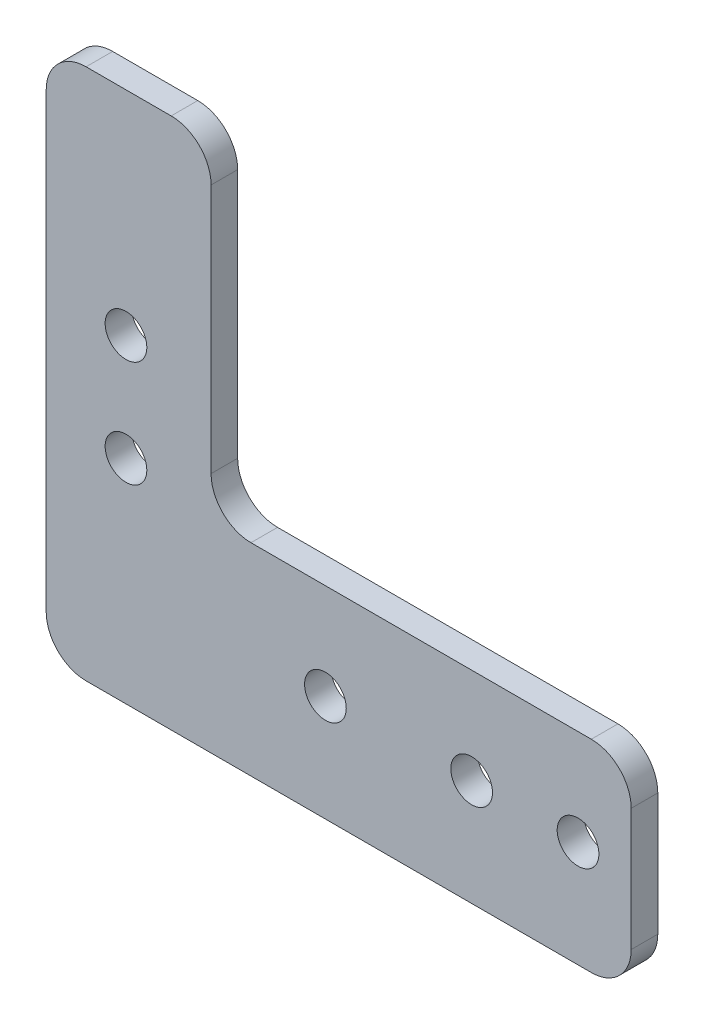
ISO-10303-21;
HEADER;
FILE_DESCRIPTION(('STEP AP214'),'2;1');
FILE_NAME('part.step','',(''),(''),'','','');
FILE_SCHEMA(('AUTOMOTIVE_DESIGN { 1 0 10303 214 1 1 1 1 }'));
ENDSEC;
DATA;
#1=APPLICATION_CONTEXT('core data for automotive mechanical design processes');
#2=APPLICATION_PROTOCOL_DEFINITION('international standard','automotive_design',2000,#1);
#3=PRODUCT_CONTEXT('',#1,'mechanical');
#4=PRODUCT('Part','Part','',(#3));
#5=PRODUCT_RELATED_PRODUCT_CATEGORY('part','',(#4));
#6=PRODUCT_DEFINITION_FORMATION('','',#4);
#7=PRODUCT_DEFINITION_CONTEXT('part definition',#1,'design');
#8=PRODUCT_DEFINITION('design','',#6,#7);
#9=PRODUCT_DEFINITION_SHAPE('','',#8);
#10=(LENGTH_UNIT() NAMED_UNIT(*) SI_UNIT(.MILLI.,.METRE.));
#11=(NAMED_UNIT(*) PLANE_ANGLE_UNIT() SI_UNIT($,.RADIAN.));
#12=(NAMED_UNIT(*) SI_UNIT($,.STERADIAN.) SOLID_ANGLE_UNIT());
#13=UNCERTAINTY_MEASURE_WITH_UNIT(LENGTH_MEASURE(1.E-05),#10,'distance_accuracy_value','');
#14=(GEOMETRIC_REPRESENTATION_CONTEXT(3) GLOBAL_UNCERTAINTY_ASSIGNED_CONTEXT((#13)) GLOBAL_UNIT_ASSIGNED_CONTEXT((#10,
#11,#12)) REPRESENTATION_CONTEXT('',''));
#15=CARTESIAN_POINT('',(0.,0.,0.));
#16=DIRECTION('',(0.,0.,1.));
#17=DIRECTION('',(1.,0.,0.));
#18=AXIS2_PLACEMENT_3D('',#15,#16,#17);
#19=CARTESIAN_POINT('',(-34.925,-31.75,-3.175));
#20=DIRECTION('',(1.,0.,0.));
#21=DIRECTION('',(0.,0.,-1.));
#22=AXIS2_PLACEMENT_3D('',#19,#20,#21);
#23=PLANE('',#22);
#24=DIRECTION('',(0.,1.,0.));
#25=VECTOR('',#24,1.);
#26=CARTESIAN_POINT('',(-34.925,-31.75,0.));
#27=LINE('',#26,#25);
#28=CARTESIAN_POINT('',(-34.925,-26.9875,0.));
#29=VERTEX_POINT('',#28);
#30=CARTESIAN_POINT('',(-34.925,26.9875,0.));
#31=VERTEX_POINT('',#30);
#32=EDGE_CURVE('E133',#29,#31,#27,.T.);
#33=ORIENTED_EDGE('',*,*,#32,.T.);
#34=DIRECTION('',(0.,0.,1.));
#35=VECTOR('',#34,1.);
#36=CARTESIAN_POINT('',(-34.925,26.9875,-3.175));
#37=LINE('',#36,#35);
#38=CARTESIAN_POINT('',(-34.925,26.9875,-3.175));
#39=VERTEX_POINT('',#38);
#40=EDGE_CURVE('E198',#31,#39,#37,.F.);
#41=ORIENTED_EDGE('',*,*,#40,.T.);
#42=DIRECTION('',(0.,1.,0.));
#43=VECTOR('',#42,1.);
#44=CARTESIAN_POINT('',(-34.925,-31.75,-3.175));
#45=LINE('',#44,#43);
#46=CARTESIAN_POINT('',(-34.925,-26.9875,-3.175));
#47=VERTEX_POINT('',#46);
#48=EDGE_CURVE('E149',#47,#39,#45,.T.);
#49=ORIENTED_EDGE('',*,*,#48,.F.);
#50=DIRECTION('',(0.,0.,1.));
#51=VECTOR('',#50,1.);
#52=CARTESIAN_POINT('',(-34.925,-26.9875,0.));
#53=LINE('',#52,#51);
#54=EDGE_CURVE('E196',#47,#29,#53,.T.);
#55=ORIENTED_EDGE('',*,*,#54,.T.);
#56=EDGE_LOOP('',(#33,#41,#49,#55));
#57=FACE_BOUND('',#56,.T.);
#58=ADVANCED_FACE('F39',(#57),#23,.F.);
#59=CARTESIAN_POINT('',(-15.24,31.75,-3.175));
#60=DIRECTION('',(0.,1.,0.));
#61=DIRECTION('',(-1.,0.,0.));
#62=AXIS2_PLACEMENT_3D('',#59,#60,#61);
#63=PLANE('',#62);
#64=DIRECTION('',(-1.,0.,0.));
#65=VECTOR('',#64,1.);
#66=CARTESIAN_POINT('',(-15.24,31.75,-3.175));
#67=LINE('',#66,#65);
#68=CARTESIAN_POINT('',(-20.0025,31.75,-3.175));
#69=VERTEX_POINT('',#68);
#70=CARTESIAN_POINT('',(-30.1625,31.75,-3.175));
#71=VERTEX_POINT('',#70);
#72=EDGE_CURVE('E221',#69,#71,#67,.T.);
#73=ORIENTED_EDGE('',*,*,#72,.T.);
#74=DIRECTION('',(0.,0.,1.));
#75=VECTOR('',#74,1.);
#76=CARTESIAN_POINT('',(-30.1625,31.75,0.));
#77=LINE('',#76,#75);
#78=CARTESIAN_POINT('',(-30.1625,31.75,0.));
#79=VERTEX_POINT('',#78);
#80=EDGE_CURVE('E193',#71,#79,#77,.T.);
#81=ORIENTED_EDGE('',*,*,#80,.T.);
#82=DIRECTION('',(-1.,0.,0.));
#83=VECTOR('',#82,1.);
#84=CARTESIAN_POINT('',(-15.24,31.75,0.));
#85=LINE('',#84,#83);
#86=CARTESIAN_POINT('',(-20.0025,31.75,0.));
#87=VERTEX_POINT('',#86);
#88=EDGE_CURVE('E211',#87,#79,#85,.T.);
#89=ORIENTED_EDGE('',*,*,#88,.F.);
#90=DIRECTION('',(0.,0.,1.));
#91=VECTOR('',#90,1.);
#92=CARTESIAN_POINT('',(-20.0025,31.75,-3.175));
#93=LINE('',#92,#91);
#94=EDGE_CURVE('E191',#87,#69,#93,.F.);
#95=ORIENTED_EDGE('',*,*,#94,.T.);
#96=EDGE_LOOP('',(#73,#81,#89,#95));
#97=FACE_BOUND('',#96,.T.);
#98=ADVANCED_FACE('F253',(#97),#63,.T.);
#99=CARTESIAN_POINT('',(-15.24,31.75,-3.175));
#100=DIRECTION('',(-1.,0.,0.));
#101=DIRECTION('',(0.,-1.,0.));
#102=AXIS2_PLACEMENT_3D('',#99,#100,#101);
#103=PLANE('',#102);
#104=DIRECTION('',(0.,-1.,0.));
#105=VECTOR('',#104,1.);
#106=CARTESIAN_POINT('',(-15.24,31.75,0.));
#107=LINE('',#106,#105);
#108=CARTESIAN_POINT('',(-15.24,26.9875,0.));
#109=VERTEX_POINT('',#108);
#110=CARTESIAN_POINT('',(-15.24,-2.85750000000001,0.));
#111=VERTEX_POINT('',#110);
#112=EDGE_CURVE('E202',#109,#111,#107,.T.);
#113=ORIENTED_EDGE('',*,*,#112,.T.);
#114=DIRECTION('',(0.,0.,1.));
#115=VECTOR('',#114,1.);
#116=CARTESIAN_POINT('',(-15.24,-2.85750000000001,-3.175));
#117=LINE('',#116,#115);
#118=CARTESIAN_POINT('',(-15.24,-2.85750000000001,-3.175));
#119=VERTEX_POINT('',#118);
#120=EDGE_CURVE('E189',#111,#119,#117,.F.);
#121=ORIENTED_EDGE('',*,*,#120,.T.);
#122=DIRECTION('',(0.,-1.,0.));
#123=VECTOR('',#122,1.);
#124=CARTESIAN_POINT('',(-15.24,31.75,-3.175));
#125=LINE('',#124,#123);
#126=CARTESIAN_POINT('',(-15.24,26.9875,-3.175));
#127=VERTEX_POINT('',#126);
#128=EDGE_CURVE('E217',#127,#119,#125,.T.);
#129=ORIENTED_EDGE('',*,*,#128,.F.);
#130=DIRECTION('',(0.,0.,1.));
#131=VECTOR('',#130,1.);
#132=CARTESIAN_POINT('',(-15.24,26.9875,0.));
#133=LINE('',#132,#131);
#134=EDGE_CURVE('E186',#127,#109,#133,.T.);
#135=ORIENTED_EDGE('',*,*,#134,.T.);
#136=EDGE_LOOP('',(#113,#121,#129,#135));
#137=FACE_BOUND('',#136,.T.);
#138=ADVANCED_FACE('F208',(#137),#103,.F.);
#139=CARTESIAN_POINT('',(34.925,-7.62000000000001,-3.175));
#140=DIRECTION('',(0.,1.,0.));
#141=DIRECTION('',(-1.,0.,0.));
#142=AXIS2_PLACEMENT_3D('',#139,#140,#141);
#143=PLANE('',#142);
#144=DIRECTION('',(-1.,0.,0.));
#145=VECTOR('',#144,1.);
#146=CARTESIAN_POINT('',(34.925,-7.62000000000001,0.));
#147=LINE('',#146,#145);
#148=CARTESIAN_POINT('',(30.1625,-7.62000000000001,0.));
#149=VERTEX_POINT('',#148);
#150=CARTESIAN_POINT('',(-10.4775,-7.62000000000001,0.));
#151=VERTEX_POINT('',#150);
#152=EDGE_CURVE('E203',#149,#151,#147,.T.);
#153=ORIENTED_EDGE('',*,*,#152,.F.);
#154=DIRECTION('',(0.,0.,1.));
#155=VECTOR('',#154,1.);
#156=CARTESIAN_POINT('',(30.1625,-7.62000000000001,-3.175));
#157=LINE('',#156,#155);
#158=CARTESIAN_POINT('',(30.1625,-7.62000000000001,-3.175));
#159=VERTEX_POINT('',#158);
#160=EDGE_CURVE('E59',#149,#159,#157,.F.);
#161=ORIENTED_EDGE('',*,*,#160,.T.);
#162=DIRECTION('',(-1.,0.,0.));
#163=VECTOR('',#162,1.);
#164=CARTESIAN_POINT('',(34.925,-7.62000000000001,-3.175));
#165=LINE('',#164,#163);
#166=CARTESIAN_POINT('',(-10.4775,-7.62000000000001,-3.175));
#167=VERTEX_POINT('',#166);
#168=EDGE_CURVE('E215',#159,#167,#165,.T.);
#169=ORIENTED_EDGE('',*,*,#168,.T.);
#170=DIRECTION('',(0.,0.,1.));
#171=VECTOR('',#170,1.);
#172=CARTESIAN_POINT('',(-10.4775,-7.62000000000001,-3.175));
#173=LINE('',#172,#171);
#174=EDGE_CURVE('E182',#167,#151,#173,.T.);
#175=ORIENTED_EDGE('',*,*,#174,.T.);
#176=EDGE_LOOP('',(#153,#161,#169,#175));
#177=FACE_BOUND('',#176,.T.);
#178=ADVANCED_FACE('F214',(#177),#143,.T.);
#179=CARTESIAN_POINT('',(34.925,-7.62000000000001,-3.175));
#180=DIRECTION('',(-1.,0.,0.));
#181=DIRECTION('',(0.,-1.,0.));
#182=AXIS2_PLACEMENT_3D('',#179,#180,#181);
#183=PLANE('',#182);
#184=DIRECTION('',(0.,-1.,0.));
#185=VECTOR('',#184,1.);
#186=CARTESIAN_POINT('',(34.925,-7.62000000000001,0.));
#187=LINE('',#186,#185);
#188=CARTESIAN_POINT('',(34.925,-12.3825,0.));
#189=VERTEX_POINT('',#188);
#190=CARTESIAN_POINT('',(34.925,-26.9875,0.));
#191=VERTEX_POINT('',#190);
#192=EDGE_CURVE('E150',#189,#191,#187,.T.);
#193=ORIENTED_EDGE('',*,*,#192,.T.);
#194=DIRECTION('',(0.,0.,1.));
#195=VECTOR('',#194,1.);
#196=CARTESIAN_POINT('',(34.925,-26.9875,-3.175));
#197=LINE('',#196,#195);
#198=CARTESIAN_POINT('',(34.925,-26.9875,-3.175));
#199=VERTEX_POINT('',#198);
#200=EDGE_CURVE('E171',#191,#199,#197,.F.);
#201=ORIENTED_EDGE('',*,*,#200,.T.);
#202=DIRECTION('',(0.,-1.,0.));
#203=VECTOR('',#202,1.);
#204=CARTESIAN_POINT('',(34.925,-7.62000000000001,-3.175));
#205=LINE('',#204,#203);
#206=CARTESIAN_POINT('',(34.925,-12.3825,-3.175));
#207=VERTEX_POINT('',#206);
#208=EDGE_CURVE('E158',#207,#199,#205,.T.);
#209=ORIENTED_EDGE('',*,*,#208,.F.);
#210=DIRECTION('',(0.,0.,1.));
#211=VECTOR('',#210,1.);
#212=CARTESIAN_POINT('',(34.925,-12.3825,0.));
#213=LINE('',#212,#211);
#214=EDGE_CURVE('E168',#207,#189,#213,.T.);
#215=ORIENTED_EDGE('',*,*,#214,.T.);
#216=EDGE_LOOP('',(#193,#201,#209,#215));
#217=FACE_BOUND('',#216,.T.);
#218=ADVANCED_FACE('F233',(#217),#183,.F.);
#219=CARTESIAN_POINT('',(-34.925,-31.75,-3.175));
#220=DIRECTION('',(0.,-1.,0.));
#221=DIRECTION('',(0.,0.,-1.));
#222=AXIS2_PLACEMENT_3D('',#219,#220,#221);
#223=PLANE('',#222);
#224=DIRECTION('',(1.,0.,0.));
#225=VECTOR('',#224,1.);
#226=CARTESIAN_POINT('',(-34.925,-31.75,-3.175));
#227=LINE('',#226,#225);
#228=CARTESIAN_POINT('',(-30.1625,-31.75,-3.175));
#229=VERTEX_POINT('',#228);
#230=CARTESIAN_POINT('',(30.1625,-31.75,-3.175));
#231=VERTEX_POINT('',#230);
#232=EDGE_CURVE('E155',#229,#231,#227,.T.);
#233=ORIENTED_EDGE('',*,*,#232,.T.);
#234=DIRECTION('',(0.,0.,1.));
#235=VECTOR('',#234,1.);
#236=CARTESIAN_POINT('',(30.1625,-31.75,0.));
#237=LINE('',#236,#235);
#238=CARTESIAN_POINT('',(30.1625,-31.75,0.));
#239=VERTEX_POINT('',#238);
#240=EDGE_CURVE('E148',#231,#239,#237,.T.);
#241=ORIENTED_EDGE('',*,*,#240,.T.);
#242=DIRECTION('',(1.,0.,0.));
#243=VECTOR('',#242,1.);
#244=CARTESIAN_POINT('',(-34.925,-31.75,0.));
#245=LINE('',#244,#243);
#246=CARTESIAN_POINT('',(-30.1625,-31.75,0.));
#247=VERTEX_POINT('',#246);
#248=EDGE_CURVE('E131',#247,#239,#245,.T.);
#249=ORIENTED_EDGE('',*,*,#248,.F.);
#250=DIRECTION('',(0.,0.,1.));
#251=VECTOR('',#250,1.);
#252=CARTESIAN_POINT('',(-30.1625,-31.75,-3.175));
#253=LINE('',#252,#251);
#254=EDGE_CURVE('E145',#247,#229,#253,.F.);
#255=ORIENTED_EDGE('',*,*,#254,.T.);
#256=EDGE_LOOP('',(#233,#241,#249,#255));
#257=FACE_BOUND('',#256,.T.);
#258=ADVANCED_FACE('F144',(#257),#223,.T.);
#259=CARTESIAN_POINT('',(0.,0.,-3.175));
#260=DIRECTION('',(0.,0.,1.));
#261=DIRECTION('',(1.,0.,0.));
#262=AXIS2_PLACEMENT_3D('',#259,#260,#261);
#263=PLANE('',#262);
#264=CARTESIAN_POINT('',(-1.58750000000001,-19.05,-3.175));
#265=DIRECTION('',(0.,0.,1.));
#266=DIRECTION('',(1.,0.,0.));
#267=AXIS2_PLACEMENT_3D('',#264,#265,#266);
#268=CIRCLE('',#267,2.4892);
#269=CARTESIAN_POINT('',(0.901699999999994,-19.05,-3.175));
#270=VERTEX_POINT('',#269);
#271=EDGE_CURVE('E299',#270,#270,#268,.T.);
#272=ORIENTED_EDGE('',*,*,#271,.T.);
#273=EDGE_LOOP('',(#272));
#274=FACE_BOUND('',#273,.T.);
#275=CARTESIAN_POINT('',(28.575,-19.05,-3.175));
#276=DIRECTION('',(0.,0.,1.));
#277=DIRECTION('',(1.,0.,0.));
#278=AXIS2_PLACEMENT_3D('',#275,#276,#277);
#279=CIRCLE('',#278,2.4892);
#280=CARTESIAN_POINT('',(31.0642,-19.05,-3.175));
#281=VERTEX_POINT('',#280);
#282=EDGE_CURVE('E307',#281,#281,#279,.T.);
#283=ORIENTED_EDGE('',*,*,#282,.T.);
#284=EDGE_LOOP('',(#283));
#285=FACE_BOUND('',#284,.T.);
#286=CARTESIAN_POINT('',(15.875,-19.05,-3.175));
#287=DIRECTION('',(0.,0.,1.));
#288=DIRECTION('',(1.,0.,0.));
#289=AXIS2_PLACEMENT_3D('',#286,#287,#288);
#290=CIRCLE('',#289,2.4892);
#291=CARTESIAN_POINT('',(18.3642,-19.05,-3.175));
#292=VERTEX_POINT('',#291);
#293=EDGE_CURVE('E313',#292,#292,#290,.T.);
#294=ORIENTED_EDGE('',*,*,#293,.T.);
#295=EDGE_LOOP('',(#294));
#296=FACE_BOUND('',#295,.T.);
#297=CARTESIAN_POINT('',(-25.4,-6.35000000000001,-3.175));
#298=DIRECTION('',(0.,0.,1.));
#299=DIRECTION('',(1.,0.,0.));
#300=AXIS2_PLACEMENT_3D('',#297,#298,#299);
#301=CIRCLE('',#300,2.4892);
#302=CARTESIAN_POINT('',(-22.9108,-6.35000000000001,-3.175));
#303=VERTEX_POINT('',#302);
#304=EDGE_CURVE('E319',#303,#303,#301,.T.);
#305=ORIENTED_EDGE('',*,*,#304,.T.);
#306=EDGE_LOOP('',(#305));
#307=FACE_BOUND('',#306,.T.);
#308=CARTESIAN_POINT('',(-25.4,6.34999999999999,-3.175));
#309=DIRECTION('',(0.,0.,1.));
#310=DIRECTION('',(1.,0.,0.));
#311=AXIS2_PLACEMENT_3D('',#308,#309,#310);
#312=CIRCLE('',#311,2.4892);
#313=CARTESIAN_POINT('',(-22.9108,6.34999999999999,-3.175));
#314=VERTEX_POINT('',#313);
#315=EDGE_CURVE('E226',#314,#314,#312,.T.);
#316=ORIENTED_EDGE('',*,*,#315,.T.);
#317=EDGE_LOOP('',(#316));
#318=FACE_BOUND('',#317,.T.);
#319=ORIENTED_EDGE('',*,*,#208,.T.);
#320=CARTESIAN_POINT('',(30.1625,-26.9875,-3.175));
#321=DIRECTION('',(0.,0.,1.));
#322=DIRECTION('',(1.,0.,0.));
#323=AXIS2_PLACEMENT_3D('',#320,#321,#322);
#324=CIRCLE('',#323,4.7625);
#325=EDGE_CURVE('E180',#199,#231,#324,.F.);
#326=ORIENTED_EDGE('',*,*,#325,.T.);
#327=ORIENTED_EDGE('',*,*,#232,.F.);
#328=CARTESIAN_POINT('',(-30.1625,-26.9875,-3.175));
#329=DIRECTION('',(0.,0.,1.));
#330=DIRECTION('',(1.,0.,0.));
#331=AXIS2_PLACEMENT_3D('',#328,#329,#330);
#332=CIRCLE('',#331,4.7625);
#333=EDGE_CURVE('E154',#229,#47,#332,.F.);
#334=ORIENTED_EDGE('',*,*,#333,.T.);
#335=ORIENTED_EDGE('',*,*,#48,.T.);
#336=CARTESIAN_POINT('',(-30.1625,26.9875,-3.175));
#337=DIRECTION('',(0.,0.,1.));
#338=DIRECTION('',(1.,0.,0.));
#339=AXIS2_PLACEMENT_3D('',#336,#337,#338);
#340=CIRCLE('',#339,4.7625);
#341=EDGE_CURVE('E176',#39,#71,#340,.F.);
#342=ORIENTED_EDGE('',*,*,#341,.T.);
#343=ORIENTED_EDGE('',*,*,#72,.F.);
#344=CARTESIAN_POINT('',(-20.0025,26.9875,-3.175));
#345=DIRECTION('',(0.,0.,1.));
#346=DIRECTION('',(1.,0.,0.));
#347=AXIS2_PLACEMENT_3D('',#344,#345,#346);
#348=CIRCLE('',#347,4.7625);
#349=EDGE_CURVE('E173',#69,#127,#348,.F.);
#350=ORIENTED_EDGE('',*,*,#349,.T.);
#351=ORIENTED_EDGE('',*,*,#128,.T.);
#352=CARTESIAN_POINT('',(-10.4775,-2.85750000000001,-3.175));
#353=DIRECTION('',(0.,0.,1.));
#354=DIRECTION('',(1.,0.,0.));
#355=AXIS2_PLACEMENT_3D('',#352,#353,#354);
#356=CIRCLE('',#355,4.7625);
#357=EDGE_CURVE('E11',#119,#167,#356,.T.);
#358=ORIENTED_EDGE('',*,*,#357,.T.);
#359=ORIENTED_EDGE('',*,*,#168,.F.);
#360=CARTESIAN_POINT('',(30.1625,-12.3825,-3.175));
#361=DIRECTION('',(0.,0.,1.));
#362=DIRECTION('',(1.,0.,0.));
#363=AXIS2_PLACEMENT_3D('',#360,#361,#362);
#364=CIRCLE('',#363,4.7625);
#365=EDGE_CURVE('E178',#159,#207,#364,.F.);
#366=ORIENTED_EDGE('',*,*,#365,.T.);
#367=EDGE_LOOP('',(#319,#326,#327,#334,#335,#342,#343,#350,#351,#358,#359,#366));
#368=FACE_BOUND('',#367,.T.);
#369=ADVANCED_FACE('F239',(#274,#285,#296,#307,#318,#368),#263,.F.);
#370=CARTESIAN_POINT('',(0.,0.,0.));
#371=DIRECTION('',(0.,0.,1.));
#372=DIRECTION('',(1.,0.,0.));
#373=AXIS2_PLACEMENT_3D('',#370,#371,#372);
#374=PLANE('',#373);
#375=CARTESIAN_POINT('',(-1.58750000000001,-19.05,0.));
#376=DIRECTION('',(0.,0.,1.));
#377=DIRECTION('',(1.,0.,0.));
#378=AXIS2_PLACEMENT_3D('',#375,#376,#377);
#379=CIRCLE('',#378,2.4892);
#380=CARTESIAN_POINT('',(0.901699999999994,-19.05,0.));
#381=VERTEX_POINT('',#380);
#382=EDGE_CURVE('E302',#381,#381,#379,.T.);
#383=ORIENTED_EDGE('',*,*,#382,.F.);
#384=EDGE_LOOP('',(#383));
#385=FACE_BOUND('',#384,.T.);
#386=CARTESIAN_POINT('',(28.575,-19.05,0.));
#387=DIRECTION('',(0.,0.,1.));
#388=DIRECTION('',(1.,0.,0.));
#389=AXIS2_PLACEMENT_3D('',#386,#387,#388);
#390=CIRCLE('',#389,2.4892);
#391=CARTESIAN_POINT('',(31.0642,-19.05,0.));
#392=VERTEX_POINT('',#391);
#393=EDGE_CURVE('E304',#392,#392,#390,.T.);
#394=ORIENTED_EDGE('',*,*,#393,.F.);
#395=EDGE_LOOP('',(#394));
#396=FACE_BOUND('',#395,.T.);
#397=CARTESIAN_POINT('',(15.875,-19.05,0.));
#398=DIRECTION('',(0.,0.,1.));
#399=DIRECTION('',(1.,0.,0.));
#400=AXIS2_PLACEMENT_3D('',#397,#398,#399);
#401=CIRCLE('',#400,2.4892);
#402=CARTESIAN_POINT('',(18.3642,-19.05,0.));
#403=VERTEX_POINT('',#402);
#404=EDGE_CURVE('E310',#403,#403,#401,.T.);
#405=ORIENTED_EDGE('',*,*,#404,.F.);
#406=EDGE_LOOP('',(#405));
#407=FACE_BOUND('',#406,.T.);
#408=CARTESIAN_POINT('',(-25.4,-6.35000000000001,0.));
#409=DIRECTION('',(0.,0.,1.));
#410=DIRECTION('',(1.,0.,0.));
#411=AXIS2_PLACEMENT_3D('',#408,#409,#410);
#412=CIRCLE('',#411,2.4892);
#413=CARTESIAN_POINT('',(-22.9108,-6.35000000000001,0.));
#414=VERTEX_POINT('',#413);
#415=EDGE_CURVE('E316',#414,#414,#412,.T.);
#416=ORIENTED_EDGE('',*,*,#415,.F.);
#417=EDGE_LOOP('',(#416));
#418=FACE_BOUND('',#417,.T.);
#419=CARTESIAN_POINT('',(-25.4,6.34999999999999,0.));
#420=DIRECTION('',(0.,0.,1.));
#421=DIRECTION('',(1.,0.,0.));
#422=AXIS2_PLACEMENT_3D('',#419,#420,#421);
#423=CIRCLE('',#422,2.4892);
#424=CARTESIAN_POINT('',(-22.9108,6.34999999999999,0.));
#425=VERTEX_POINT('',#424);
#426=EDGE_CURVE('E322',#425,#425,#423,.T.);
#427=ORIENTED_EDGE('',*,*,#426,.F.);
#428=EDGE_LOOP('',(#427));
#429=FACE_BOUND('',#428,.T.);
#430=ORIENTED_EDGE('',*,*,#248,.T.);
#431=CARTESIAN_POINT('',(30.1625,-26.9875,0.));
#432=DIRECTION('',(0.,0.,1.));
#433=DIRECTION('',(1.,0.,0.));
#434=AXIS2_PLACEMENT_3D('',#431,#432,#433);
#435=CIRCLE('',#434,4.7625);
#436=EDGE_CURVE('E166',#239,#191,#435,.T.);
#437=ORIENTED_EDGE('',*,*,#436,.T.);
#438=ORIENTED_EDGE('',*,*,#192,.F.);
#439=CARTESIAN_POINT('',(30.1625,-12.3825,0.));
#440=DIRECTION('',(0.,0.,1.));
#441=DIRECTION('',(1.,0.,0.));
#442=AXIS2_PLACEMENT_3D('',#439,#440,#441);
#443=CIRCLE('',#442,4.7625);
#444=EDGE_CURVE('E164',#189,#149,#443,.T.);
#445=ORIENTED_EDGE('',*,*,#444,.T.);
#446=ORIENTED_EDGE('',*,*,#152,.T.);
#447=CARTESIAN_POINT('',(-10.4775,-2.85750000000001,0.));
#448=DIRECTION('',(0.,0.,1.));
#449=DIRECTION('',(1.,0.,0.));
#450=AXIS2_PLACEMENT_3D('',#447,#448,#449);
#451=CIRCLE('',#450,4.7625);
#452=EDGE_CURVE('E47',#151,#111,#451,.F.);
#453=ORIENTED_EDGE('',*,*,#452,.T.);
#454=ORIENTED_EDGE('',*,*,#112,.F.);
#455=CARTESIAN_POINT('',(-20.0025,26.9875,0.));
#456=DIRECTION('',(0.,0.,1.));
#457=DIRECTION('',(1.,0.,0.));
#458=AXIS2_PLACEMENT_3D('',#455,#456,#457);
#459=CIRCLE('',#458,4.7625);
#460=EDGE_CURVE('E139',#109,#87,#459,.T.);
#461=ORIENTED_EDGE('',*,*,#460,.T.);
#462=ORIENTED_EDGE('',*,*,#88,.T.);
#463=CARTESIAN_POINT('',(-30.1625,26.9875,0.));
#464=DIRECTION('',(0.,0.,1.));
#465=DIRECTION('',(1.,0.,0.));
#466=AXIS2_PLACEMENT_3D('',#463,#464,#465);
#467=CIRCLE('',#466,4.7625);
#468=EDGE_CURVE('E138',#79,#31,#467,.T.);
#469=ORIENTED_EDGE('',*,*,#468,.T.);
#470=ORIENTED_EDGE('',*,*,#32,.F.);
#471=CARTESIAN_POINT('',(-30.1625,-26.9875,0.));
#472=DIRECTION('',(0.,0.,1.));
#473=DIRECTION('',(1.,0.,0.));
#474=AXIS2_PLACEMENT_3D('',#471,#472,#473);
#475=CIRCLE('',#474,4.7625);
#476=EDGE_CURVE('E128',#29,#247,#475,.T.);
#477=ORIENTED_EDGE('',*,*,#476,.T.);
#478=EDGE_LOOP('',(#430,#437,#438,#445,#446,#453,#454,#461,#462,#469,#470,#477));
#479=FACE_BOUND('',#478,.T.);
#480=ADVANCED_FACE('F130',(#385,#396,#407,#418,#429,#479),#374,.T.);
#481=CARTESIAN_POINT('',(-25.4,6.34999999999999,-3.175));
#482=DIRECTION('',(0.,0.,1.));
#483=DIRECTION('',(1.,0.,0.));
#484=AXIS2_PLACEMENT_3D('',#481,#482,#483);
#485=CYLINDRICAL_SURFACE('',#484,2.4892);
#486=ORIENTED_EDGE('',*,*,#315,.F.);
#487=EDGE_LOOP('',(#486));
#488=FACE_BOUND('',#487,.T.);
#489=ORIENTED_EDGE('',*,*,#426,.T.);
#490=EDGE_LOOP('',(#489));
#491=FACE_BOUND('',#490,.T.);
#492=ADVANCED_FACE('F272',(#488,#491),#485,.F.);
#493=CARTESIAN_POINT('',(-25.4,-6.35000000000001,-3.175));
#494=DIRECTION('',(0.,0.,1.));
#495=DIRECTION('',(1.,0.,0.));
#496=AXIS2_PLACEMENT_3D('',#493,#494,#495);
#497=CYLINDRICAL_SURFACE('',#496,2.4892);
#498=ORIENTED_EDGE('',*,*,#304,.F.);
#499=EDGE_LOOP('',(#498));
#500=FACE_BOUND('',#499,.T.);
#501=ORIENTED_EDGE('',*,*,#415,.T.);
#502=EDGE_LOOP('',(#501));
#503=FACE_BOUND('',#502,.T.);
#504=ADVANCED_FACE('F279',(#500,#503),#497,.F.);
#505=CARTESIAN_POINT('',(15.875,-19.05,-3.175));
#506=DIRECTION('',(0.,0.,1.));
#507=DIRECTION('',(1.,0.,0.));
#508=AXIS2_PLACEMENT_3D('',#505,#506,#507);
#509=CYLINDRICAL_SURFACE('',#508,2.4892);
#510=ORIENTED_EDGE('',*,*,#293,.F.);
#511=EDGE_LOOP('',(#510));
#512=FACE_BOUND('',#511,.T.);
#513=ORIENTED_EDGE('',*,*,#404,.T.);
#514=EDGE_LOOP('',(#513));
#515=FACE_BOUND('',#514,.T.);
#516=ADVANCED_FACE('F283',(#512,#515),#509,.F.);
#517=CARTESIAN_POINT('',(28.575,-19.05,-3.175));
#518=DIRECTION('',(0.,0.,1.));
#519=DIRECTION('',(1.,0.,0.));
#520=AXIS2_PLACEMENT_3D('',#517,#518,#519);
#521=CYLINDRICAL_SURFACE('',#520,2.4892);
#522=ORIENTED_EDGE('',*,*,#282,.F.);
#523=EDGE_LOOP('',(#522));
#524=FACE_BOUND('',#523,.T.);
#525=ORIENTED_EDGE('',*,*,#393,.T.);
#526=EDGE_LOOP('',(#525));
#527=FACE_BOUND('',#526,.T.);
#528=ADVANCED_FACE('F287',(#524,#527),#521,.F.);
#529=CARTESIAN_POINT('',(-1.58750000000001,-19.05,-3.175));
#530=DIRECTION('',(0.,0.,1.));
#531=DIRECTION('',(1.,0.,0.));
#532=AXIS2_PLACEMENT_3D('',#529,#530,#531);
#533=CYLINDRICAL_SURFACE('',#532,2.4892);
#534=ORIENTED_EDGE('',*,*,#271,.F.);
#535=EDGE_LOOP('',(#534));
#536=FACE_BOUND('',#535,.T.);
#537=ORIENTED_EDGE('',*,*,#382,.T.);
#538=EDGE_LOOP('',(#537));
#539=FACE_BOUND('',#538,.T.);
#540=ADVANCED_FACE('F250',(#536,#539),#533,.F.);
#541=CARTESIAN_POINT('',(30.1625,-26.9875,-3.175));
#542=DIRECTION('',(0.,0.,-1.));
#543=DIRECTION('',(-1.,0.,0.));
#544=AXIS2_PLACEMENT_3D('',#541,#542,#543);
#545=CYLINDRICAL_SURFACE('',#544,4.7625);
#546=ORIENTED_EDGE('',*,*,#325,.F.);
#547=ORIENTED_EDGE('',*,*,#200,.F.);
#548=ORIENTED_EDGE('',*,*,#436,.F.);
#549=ORIENTED_EDGE('',*,*,#240,.F.);
#550=EDGE_LOOP('',(#546,#547,#548,#549));
#551=FACE_BOUND('',#550,.T.);
#552=ADVANCED_FACE('F238',(#551),#545,.T.);
#553=CARTESIAN_POINT('',(30.1625,-12.3825,-3.175));
#554=DIRECTION('',(0.,0.,-1.));
#555=DIRECTION('',(-1.,0.,0.));
#556=AXIS2_PLACEMENT_3D('',#553,#554,#555);
#557=CYLINDRICAL_SURFACE('',#556,4.7625);
#558=ORIENTED_EDGE('',*,*,#365,.F.);
#559=ORIENTED_EDGE('',*,*,#160,.F.);
#560=ORIENTED_EDGE('',*,*,#444,.F.);
#561=ORIENTED_EDGE('',*,*,#214,.F.);
#562=EDGE_LOOP('',(#558,#559,#560,#561));
#563=FACE_BOUND('',#562,.T.);
#564=ADVANCED_FACE('F241',(#563),#557,.T.);
#565=CARTESIAN_POINT('',(-10.4775,-2.85750000000001,-3.175));
#566=DIRECTION('',(0.,0.,1.));
#567=DIRECTION('',(1.,0.,0.));
#568=AXIS2_PLACEMENT_3D('',#565,#566,#567);
#569=CYLINDRICAL_SURFACE('',#568,4.7625);
#570=ORIENTED_EDGE('',*,*,#357,.F.);
#571=ORIENTED_EDGE('',*,*,#120,.F.);
#572=ORIENTED_EDGE('',*,*,#452,.F.);
#573=ORIENTED_EDGE('',*,*,#174,.F.);
#574=EDGE_LOOP('',(#570,#571,#572,#573));
#575=FACE_BOUND('',#574,.T.);
#576=ADVANCED_FACE('F213',(#575),#569,.F.);
#577=CARTESIAN_POINT('',(-30.1625,26.9875,-3.175));
#578=DIRECTION('',(0.,0.,-1.));
#579=DIRECTION('',(-1.,0.,0.));
#580=AXIS2_PLACEMENT_3D('',#577,#578,#579);
#581=CYLINDRICAL_SURFACE('',#580,4.7625);
#582=ORIENTED_EDGE('',*,*,#341,.F.);
#583=ORIENTED_EDGE('',*,*,#40,.F.);
#584=ORIENTED_EDGE('',*,*,#468,.F.);
#585=ORIENTED_EDGE('',*,*,#80,.F.);
#586=EDGE_LOOP('',(#582,#583,#584,#585));
#587=FACE_BOUND('',#586,.T.);
#588=ADVANCED_FACE('F248',(#587),#581,.T.);
#589=CARTESIAN_POINT('',(-30.1625,-26.9875,-3.175));
#590=DIRECTION('',(0.,0.,-1.));
#591=DIRECTION('',(-1.,0.,0.));
#592=AXIS2_PLACEMENT_3D('',#589,#590,#591);
#593=CYLINDRICAL_SURFACE('',#592,4.7625);
#594=ORIENTED_EDGE('',*,*,#333,.F.);
#595=ORIENTED_EDGE('',*,*,#254,.F.);
#596=ORIENTED_EDGE('',*,*,#476,.F.);
#597=ORIENTED_EDGE('',*,*,#54,.F.);
#598=EDGE_LOOP('',(#594,#595,#596,#597));
#599=FACE_BOUND('',#598,.T.);
#600=ADVANCED_FACE('F153',(#599),#593,.T.);
#601=CARTESIAN_POINT('',(-20.0025,26.9875,-3.175));
#602=DIRECTION('',(0.,0.,-1.));
#603=DIRECTION('',(-1.,0.,0.));
#604=AXIS2_PLACEMENT_3D('',#601,#602,#603);
#605=CYLINDRICAL_SURFACE('',#604,4.7625);
#606=ORIENTED_EDGE('',*,*,#349,.F.);
#607=ORIENTED_EDGE('',*,*,#94,.F.);
#608=ORIENTED_EDGE('',*,*,#460,.F.);
#609=ORIENTED_EDGE('',*,*,#134,.F.);
#610=EDGE_LOOP('',(#606,#607,#608,#609));
#611=FACE_BOUND('',#610,.T.);
#612=ADVANCED_FACE('F41',(#611),#605,.T.);
#613=CLOSED_SHELL('',(#58,#98,#138,#178,#218,#258,#369,#480,#492,#504,#516,#528,#540,#552,#564,
#576,#588,#600,#612));
#614=MANIFOLD_SOLID_BREP('B2',#613);
#615=ADVANCED_BREP_SHAPE_REPRESENTATION('',(#18,#614),#14);
#616=SHAPE_DEFINITION_REPRESENTATION(#9,#615);
ENDSEC;
END-ISO-10303-21;
